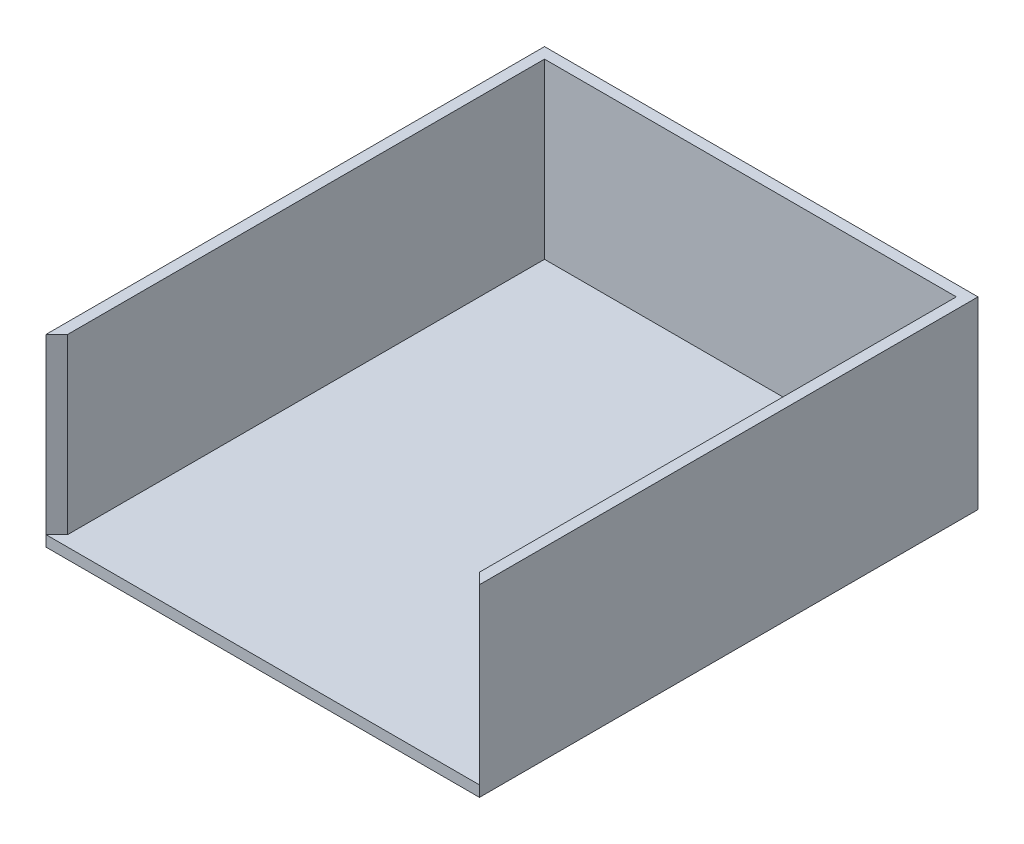
ISO-10303-21;
HEADER;
FILE_DESCRIPTION(('STEP AP214'),'2;1');
FILE_NAME('part.step','',(''),(''),'','','');
FILE_SCHEMA(('AUTOMOTIVE_DESIGN { 1 0 10303 214 1 1 1 1 }'));
ENDSEC;
DATA;
#1=APPLICATION_CONTEXT('core data for automotive mechanical design processes');
#2=APPLICATION_PROTOCOL_DEFINITION('international standard','automotive_design',2000,#1);
#3=PRODUCT_CONTEXT('',#1,'mechanical');
#4=PRODUCT('Part','Part','',(#3));
#5=PRODUCT_RELATED_PRODUCT_CATEGORY('part','',(#4));
#6=PRODUCT_DEFINITION_FORMATION('','',#4);
#7=PRODUCT_DEFINITION_CONTEXT('part definition',#1,'design');
#8=PRODUCT_DEFINITION('design','',#6,#7);
#9=PRODUCT_DEFINITION_SHAPE('','',#8);
#10=(LENGTH_UNIT() NAMED_UNIT(*) SI_UNIT(.MILLI.,.METRE.));
#11=(NAMED_UNIT(*) PLANE_ANGLE_UNIT() SI_UNIT($,.RADIAN.));
#12=(NAMED_UNIT(*) SI_UNIT($,.STERADIAN.) SOLID_ANGLE_UNIT());
#13=UNCERTAINTY_MEASURE_WITH_UNIT(LENGTH_MEASURE(1.E-05),#10,'distance_accuracy_value','');
#14=(GEOMETRIC_REPRESENTATION_CONTEXT(3) GLOBAL_UNCERTAINTY_ASSIGNED_CONTEXT((#13)) GLOBAL_UNIT_ASSIGNED_CONTEXT((#10,
#11,#12)) REPRESENTATION_CONTEXT('',''));
#15=CARTESIAN_POINT('',(0.,0.,0.));
#16=DIRECTION('',(0.,0.,1.));
#17=DIRECTION('',(1.,0.,0.));
#18=AXIS2_PLACEMENT_3D('',#15,#16,#17);
#19=CARTESIAN_POINT('',(0.,5.,0.));
#20=DIRECTION('',(0.,-1.,0.));
#21=DIRECTION('',(0.,0.,-1.));
#22=AXIS2_PLACEMENT_3D('',#19,#20,#21);
#23=PLANE('',#22);
#24=DIRECTION('',(0.707106781186547,0.,0.707106781186547));
#25=VECTOR('',#24,1.);
#26=CARTESIAN_POINT('',(100.,5.,115.));
#27=LINE('',#26,#25);
#28=CARTESIAN_POINT('',(95.,5.,110.));
#29=VERTEX_POINT('',#28);
#30=CARTESIAN_POINT('',(100.,5.,115.));
#31=VERTEX_POINT('',#30);
#32=EDGE_CURVE('E48',#29,#31,#27,.T.);
#33=ORIENTED_EDGE('',*,*,#32,.F.);
#34=DIRECTION('',(0.,0.,1.));
#35=VECTOR('',#34,1.);
#36=CARTESIAN_POINT('',(95.,5.,110.));
#37=LINE('',#36,#35);
#38=CARTESIAN_POINT('',(95.,5.,-110.));
#39=VERTEX_POINT('',#38);
#40=EDGE_CURVE('E52',#39,#29,#37,.T.);
#41=ORIENTED_EDGE('',*,*,#40,.F.);
#42=DIRECTION('',(1.,0.,0.));
#43=VECTOR('',#42,1.);
#44=CARTESIAN_POINT('',(95.,5.,-110.));
#45=LINE('',#44,#43);
#46=CARTESIAN_POINT('',(-95.,5.,-110.));
#47=VERTEX_POINT('',#46);
#48=EDGE_CURVE('E185',#47,#39,#45,.T.);
#49=ORIENTED_EDGE('',*,*,#48,.F.);
#50=DIRECTION('',(0.,0.,-1.));
#51=VECTOR('',#50,1.);
#52=CARTESIAN_POINT('',(-95.,5.,-110.));
#53=LINE('',#52,#51);
#54=CARTESIAN_POINT('',(-95.,5.,110.));
#55=VERTEX_POINT('',#54);
#56=EDGE_CURVE('E182',#55,#47,#53,.T.);
#57=ORIENTED_EDGE('',*,*,#56,.F.);
#58=DIRECTION('',(0.707106781186547,0.,-0.707106781186547));
#59=VECTOR('',#58,1.);
#60=CARTESIAN_POINT('',(-100.,5.,115.));
#61=LINE('',#60,#59);
#62=CARTESIAN_POINT('',(-100.,5.,115.));
#63=VERTEX_POINT('',#62);
#64=EDGE_CURVE('E180',#63,#55,#61,.T.);
#65=ORIENTED_EDGE('',*,*,#64,.F.);
#66=DIRECTION('',(1.,0.,0.));
#67=VECTOR('',#66,1.);
#68=CARTESIAN_POINT('',(-100.,5.,115.));
#69=LINE('',#68,#67);
#70=EDGE_CURVE('E133',#63,#31,#69,.T.);
#71=ORIENTED_EDGE('',*,*,#70,.T.);
#72=EDGE_LOOP('',(#33,#41,#49,#57,#65,#71));
#73=FACE_BOUND('',#72,.T.);
#74=ADVANCED_FACE('F33',(#73),#23,.F.);
#75=CARTESIAN_POINT('',(100.,5.,115.));
#76=DIRECTION('',(-1.,0.,0.));
#77=DIRECTION('',(0.,0.,1.));
#78=AXIS2_PLACEMENT_3D('',#75,#76,#77);
#79=PLANE('',#78);
#80=DIRECTION('',(0.,0.,-1.));
#81=VECTOR('',#80,1.);
#82=CARTESIAN_POINT('',(100.,0.,115.));
#83=LINE('',#82,#81);
#84=CARTESIAN_POINT('',(100.,0.,115.));
#85=VERTEX_POINT('',#84);
#86=CARTESIAN_POINT('',(100.,0.,-115.));
#87=VERTEX_POINT('',#86);
#88=EDGE_CURVE('E123',#85,#87,#83,.T.);
#89=ORIENTED_EDGE('',*,*,#88,.T.);
#90=DIRECTION('',(0.,-1.,0.));
#91=VECTOR('',#90,1.);
#92=CARTESIAN_POINT('',(100.,5.,-115.));
#93=LINE('',#92,#91);
#94=CARTESIAN_POINT('',(100.,85.,-115.));
#95=VERTEX_POINT('',#94);
#96=EDGE_CURVE('E11',#95,#87,#93,.T.);
#97=ORIENTED_EDGE('',*,*,#96,.F.);
#98=DIRECTION('',(0.,0.,-1.));
#99=VECTOR('',#98,1.);
#100=CARTESIAN_POINT('',(100.,85.,115.));
#101=LINE('',#100,#99);
#102=CARTESIAN_POINT('',(100.,85.,115.));
#103=VERTEX_POINT('',#102);
#104=EDGE_CURVE('E102',#103,#95,#101,.T.);
#105=ORIENTED_EDGE('',*,*,#104,.F.);
#106=DIRECTION('',(0.,-1.,0.));
#107=VECTOR('',#106,1.);
#108=CARTESIAN_POINT('',(100.,85.,115.));
#109=LINE('',#108,#107);
#110=EDGE_CURVE('E107',#103,#31,#109,.T.);
#111=ORIENTED_EDGE('',*,*,#110,.T.);
#112=DIRECTION('',(0.,-1.,0.));
#113=VECTOR('',#112,1.);
#114=CARTESIAN_POINT('',(100.,5.,115.));
#115=LINE('',#114,#113);
#116=EDGE_CURVE('E134',#31,#85,#115,.T.);
#117=ORIENTED_EDGE('',*,*,#116,.T.);
#118=EDGE_LOOP('',(#89,#97,#105,#111,#117));
#119=FACE_BOUND('',#118,.T.);
#120=ADVANCED_FACE('F35',(#119),#79,.F.);
#121=CARTESIAN_POINT('',(-100.,5.,-115.));
#122=DIRECTION('',(0.,0.,1.));
#123=DIRECTION('',(1.,0.,0.));
#124=AXIS2_PLACEMENT_3D('',#121,#122,#123);
#125=PLANE('',#124);
#126=DIRECTION('',(-1.,0.,0.));
#127=VECTOR('',#126,1.);
#128=CARTESIAN_POINT('',(-100.,0.,-115.));
#129=LINE('',#128,#127);
#130=CARTESIAN_POINT('',(-100.,0.,-115.));
#131=VERTEX_POINT('',#130);
#132=EDGE_CURVE('E126',#87,#131,#129,.T.);
#133=ORIENTED_EDGE('',*,*,#132,.T.);
#134=DIRECTION('',(0.,-1.,0.));
#135=VECTOR('',#134,1.);
#136=CARTESIAN_POINT('',(-100.,5.,-115.));
#137=LINE('',#136,#135);
#138=CARTESIAN_POINT('',(-100.,85.,-115.));
#139=VERTEX_POINT('',#138);
#140=EDGE_CURVE('E41',#139,#131,#137,.T.);
#141=ORIENTED_EDGE('',*,*,#140,.F.);
#142=DIRECTION('',(-1.,0.,0.));
#143=VECTOR('',#142,1.);
#144=CARTESIAN_POINT('',(100.,85.,-115.));
#145=LINE('',#144,#143);
#146=EDGE_CURVE('E111',#95,#139,#145,.T.);
#147=ORIENTED_EDGE('',*,*,#146,.F.);
#148=ORIENTED_EDGE('',*,*,#96,.T.);
#149=EDGE_LOOP('',(#133,#141,#147,#148));
#150=FACE_BOUND('',#149,.T.);
#151=ADVANCED_FACE('F216',(#150),#125,.F.);
#152=CARTESIAN_POINT('',(-100.,5.,115.));
#153=DIRECTION('',(1.,0.,0.));
#154=DIRECTION('',(0.,0.,-1.));
#155=AXIS2_PLACEMENT_3D('',#152,#153,#154);
#156=PLANE('',#155);
#157=DIRECTION('',(0.,0.,1.));
#158=VECTOR('',#157,1.);
#159=CARTESIAN_POINT('',(-100.,0.,115.));
#160=LINE('',#159,#158);
#161=CARTESIAN_POINT('',(-100.,0.,115.));
#162=VERTEX_POINT('',#161);
#163=EDGE_CURVE('E138',#131,#162,#160,.T.);
#164=ORIENTED_EDGE('',*,*,#163,.T.);
#165=DIRECTION('',(0.,-1.,0.));
#166=VECTOR('',#165,1.);
#167=CARTESIAN_POINT('',(-100.,5.,115.));
#168=LINE('',#167,#166);
#169=EDGE_CURVE('E142',#63,#162,#168,.T.);
#170=ORIENTED_EDGE('',*,*,#169,.F.);
#171=DIRECTION('',(0.,-1.,0.));
#172=VECTOR('',#171,1.);
#173=CARTESIAN_POINT('',(-100.,85.,115.));
#174=LINE('',#173,#172);
#175=CARTESIAN_POINT('',(-100.,85.,115.));
#176=VERTEX_POINT('',#175);
#177=EDGE_CURVE('E124',#176,#63,#174,.T.);
#178=ORIENTED_EDGE('',*,*,#177,.F.);
#179=DIRECTION('',(0.,0.,1.));
#180=VECTOR('',#179,1.);
#181=CARTESIAN_POINT('',(-100.,85.,-115.));
#182=LINE('',#181,#180);
#183=EDGE_CURVE('E151',#139,#176,#182,.T.);
#184=ORIENTED_EDGE('',*,*,#183,.F.);
#185=ORIENTED_EDGE('',*,*,#140,.T.);
#186=EDGE_LOOP('',(#164,#170,#178,#184,#185));
#187=FACE_BOUND('',#186,.T.);
#188=ADVANCED_FACE('F148',(#187),#156,.F.);
#189=CARTESIAN_POINT('',(-100.,5.,115.));
#190=DIRECTION('',(0.,0.,-1.));
#191=DIRECTION('',(-1.,0.,0.));
#192=AXIS2_PLACEMENT_3D('',#189,#190,#191);
#193=PLANE('',#192);
#194=DIRECTION('',(1.,0.,0.));
#195=VECTOR('',#194,1.);
#196=CARTESIAN_POINT('',(-100.,0.,115.));
#197=LINE('',#196,#195);
#198=EDGE_CURVE('E135',#162,#85,#197,.T.);
#199=ORIENTED_EDGE('',*,*,#198,.T.);
#200=ORIENTED_EDGE('',*,*,#116,.F.);
#201=ORIENTED_EDGE('',*,*,#70,.F.);
#202=ORIENTED_EDGE('',*,*,#169,.T.);
#203=EDGE_LOOP('',(#199,#200,#201,#202));
#204=FACE_BOUND('',#203,.T.);
#205=ADVANCED_FACE('F159',(#204),#193,.F.);
#206=CARTESIAN_POINT('',(0.,0.,0.));
#207=DIRECTION('',(0.,-1.,0.));
#208=DIRECTION('',(0.,0.,-1.));
#209=AXIS2_PLACEMENT_3D('',#206,#207,#208);
#210=PLANE('',#209);
#211=ORIENTED_EDGE('',*,*,#88,.F.);
#212=ORIENTED_EDGE('',*,*,#198,.F.);
#213=ORIENTED_EDGE('',*,*,#163,.F.);
#214=ORIENTED_EDGE('',*,*,#132,.F.);
#215=EDGE_LOOP('',(#211,#212,#213,#214));
#216=FACE_BOUND('',#215,.T.);
#217=ADVANCED_FACE('F156',(#216),#210,.T.);
#218=CARTESIAN_POINT('',(100.,85.,115.));
#219=DIRECTION('',(0.707106781186548,0.,-0.707106781186548));
#220=DIRECTION('',(-0.707106781186548,0.,-0.707106781186548));
#221=AXIS2_PLACEMENT_3D('',#218,#219,#220);
#222=PLANE('',#221);
#223=ORIENTED_EDGE('',*,*,#32,.T.);
#224=ORIENTED_EDGE('',*,*,#110,.F.);
#225=DIRECTION('',(0.707106781186547,0.,0.707106781186547));
#226=VECTOR('',#225,1.);
#227=CARTESIAN_POINT('',(100.,85.,115.));
#228=LINE('',#227,#226);
#229=CARTESIAN_POINT('',(95.,85.,110.));
#230=VERTEX_POINT('',#229);
#231=EDGE_CURVE('E112',#230,#103,#228,.T.);
#232=ORIENTED_EDGE('',*,*,#231,.F.);
#233=DIRECTION('',(0.,-1.,0.));
#234=VECTOR('',#233,1.);
#235=CARTESIAN_POINT('',(95.,85.,110.));
#236=LINE('',#235,#234);
#237=EDGE_CURVE('E178',#230,#29,#236,.T.);
#238=ORIENTED_EDGE('',*,*,#237,.T.);
#239=EDGE_LOOP('',(#223,#224,#232,#238));
#240=FACE_BOUND('',#239,.T.);
#241=ADVANCED_FACE('F122',(#240),#222,.F.);
#242=CARTESIAN_POINT('',(-100.,85.,115.));
#243=DIRECTION('',(-0.707106781186548,0.,-0.707106781186548));
#244=DIRECTION('',(-0.707106781186548,0.,0.707106781186548));
#245=AXIS2_PLACEMENT_3D('',#242,#243,#244);
#246=PLANE('',#245);
#247=ORIENTED_EDGE('',*,*,#64,.T.);
#248=DIRECTION('',(0.,-1.,0.));
#249=VECTOR('',#248,1.);
#250=CARTESIAN_POINT('',(-95.,85.,110.));
#251=LINE('',#250,#249);
#252=CARTESIAN_POINT('',(-95.,85.,110.));
#253=VERTEX_POINT('',#252);
#254=EDGE_CURVE('E129',#253,#55,#251,.T.);
#255=ORIENTED_EDGE('',*,*,#254,.F.);
#256=DIRECTION('',(0.707106781186547,0.,-0.707106781186547));
#257=VECTOR('',#256,1.);
#258=CARTESIAN_POINT('',(-100.,85.,115.));
#259=LINE('',#258,#257);
#260=EDGE_CURVE('E165',#176,#253,#259,.T.);
#261=ORIENTED_EDGE('',*,*,#260,.F.);
#262=ORIENTED_EDGE('',*,*,#177,.T.);
#263=EDGE_LOOP('',(#247,#255,#261,#262));
#264=FACE_BOUND('',#263,.T.);
#265=ADVANCED_FACE('F166',(#264),#246,.F.);
#266=CARTESIAN_POINT('',(-95.,85.,-110.));
#267=DIRECTION('',(-1.,0.,0.));
#268=DIRECTION('',(0.,0.,1.));
#269=AXIS2_PLACEMENT_3D('',#266,#267,#268);
#270=PLANE('',#269);
#271=ORIENTED_EDGE('',*,*,#56,.T.);
#272=DIRECTION('',(0.,-1.,0.));
#273=VECTOR('',#272,1.);
#274=CARTESIAN_POINT('',(-95.,85.,-110.));
#275=LINE('',#274,#273);
#276=CARTESIAN_POINT('',(-95.,85.,-110.));
#277=VERTEX_POINT('',#276);
#278=EDGE_CURVE('E192',#277,#47,#275,.T.);
#279=ORIENTED_EDGE('',*,*,#278,.F.);
#280=DIRECTION('',(0.,0.,-1.));
#281=VECTOR('',#280,1.);
#282=CARTESIAN_POINT('',(-95.,85.,-110.));
#283=LINE('',#282,#281);
#284=EDGE_CURVE('E169',#253,#277,#283,.T.);
#285=ORIENTED_EDGE('',*,*,#284,.F.);
#286=ORIENTED_EDGE('',*,*,#254,.T.);
#287=EDGE_LOOP('',(#271,#279,#285,#286));
#288=FACE_BOUND('',#287,.T.);
#289=ADVANCED_FACE('F195',(#288),#270,.F.);
#290=CARTESIAN_POINT('',(95.,85.,-110.));
#291=DIRECTION('',(0.,0.,-1.));
#292=DIRECTION('',(-1.,0.,0.));
#293=AXIS2_PLACEMENT_3D('',#290,#291,#292);
#294=PLANE('',#293);
#295=ORIENTED_EDGE('',*,*,#48,.T.);
#296=DIRECTION('',(0.,-1.,0.));
#297=VECTOR('',#296,1.);
#298=CARTESIAN_POINT('',(95.,85.,-110.));
#299=LINE('',#298,#297);
#300=CARTESIAN_POINT('',(95.,85.,-110.));
#301=VERTEX_POINT('',#300);
#302=EDGE_CURVE('E189',#301,#39,#299,.T.);
#303=ORIENTED_EDGE('',*,*,#302,.F.);
#304=DIRECTION('',(1.,0.,0.));
#305=VECTOR('',#304,1.);
#306=CARTESIAN_POINT('',(95.,85.,-110.));
#307=LINE('',#306,#305);
#308=EDGE_CURVE('E171',#277,#301,#307,.T.);
#309=ORIENTED_EDGE('',*,*,#308,.F.);
#310=ORIENTED_EDGE('',*,*,#278,.T.);
#311=EDGE_LOOP('',(#295,#303,#309,#310));
#312=FACE_BOUND('',#311,.T.);
#313=ADVANCED_FACE('F200',(#312),#294,.F.);
#314=CARTESIAN_POINT('',(95.,85.,110.));
#315=DIRECTION('',(1.,0.,0.));
#316=DIRECTION('',(0.,0.,-1.));
#317=AXIS2_PLACEMENT_3D('',#314,#315,#316);
#318=PLANE('',#317);
#319=ORIENTED_EDGE('',*,*,#40,.T.);
#320=ORIENTED_EDGE('',*,*,#237,.F.);
#321=DIRECTION('',(0.,0.,1.));
#322=VECTOR('',#321,1.);
#323=CARTESIAN_POINT('',(95.,85.,110.));
#324=LINE('',#323,#322);
#325=EDGE_CURVE('E117',#301,#230,#324,.T.);
#326=ORIENTED_EDGE('',*,*,#325,.F.);
#327=ORIENTED_EDGE('',*,*,#302,.T.);
#328=EDGE_LOOP('',(#319,#320,#326,#327));
#329=FACE_BOUND('',#328,.T.);
#330=ADVANCED_FACE('F202',(#329),#318,.F.);
#331=CARTESIAN_POINT('',(0.,85.,0.));
#332=DIRECTION('',(0.,-1.,0.));
#333=DIRECTION('',(0.,0.,-1.));
#334=AXIS2_PLACEMENT_3D('',#331,#332,#333);
#335=PLANE('',#334);
#336=ORIENTED_EDGE('',*,*,#231,.T.);
#337=ORIENTED_EDGE('',*,*,#104,.T.);
#338=ORIENTED_EDGE('',*,*,#146,.T.);
#339=ORIENTED_EDGE('',*,*,#183,.T.);
#340=ORIENTED_EDGE('',*,*,#260,.T.);
#341=ORIENTED_EDGE('',*,*,#284,.T.);
#342=ORIENTED_EDGE('',*,*,#308,.T.);
#343=ORIENTED_EDGE('',*,*,#325,.T.);
#344=EDGE_LOOP('',(#336,#337,#338,#339,#340,#341,#342,#343));
#345=FACE_BOUND('',#344,.T.);
#346=ADVANCED_FACE('F115',(#345),#335,.F.);
#347=CLOSED_SHELL('',(#74,#120,#151,#188,#205,#217,#241,#265,#289,#313,#330,#346));
#348=MANIFOLD_SOLID_BREP('B2',#347);
#349=ADVANCED_BREP_SHAPE_REPRESENTATION('',(#18,#348),#14);
#350=SHAPE_DEFINITION_REPRESENTATION(#9,#349);
ENDSEC;
END-ISO-10303-21;
